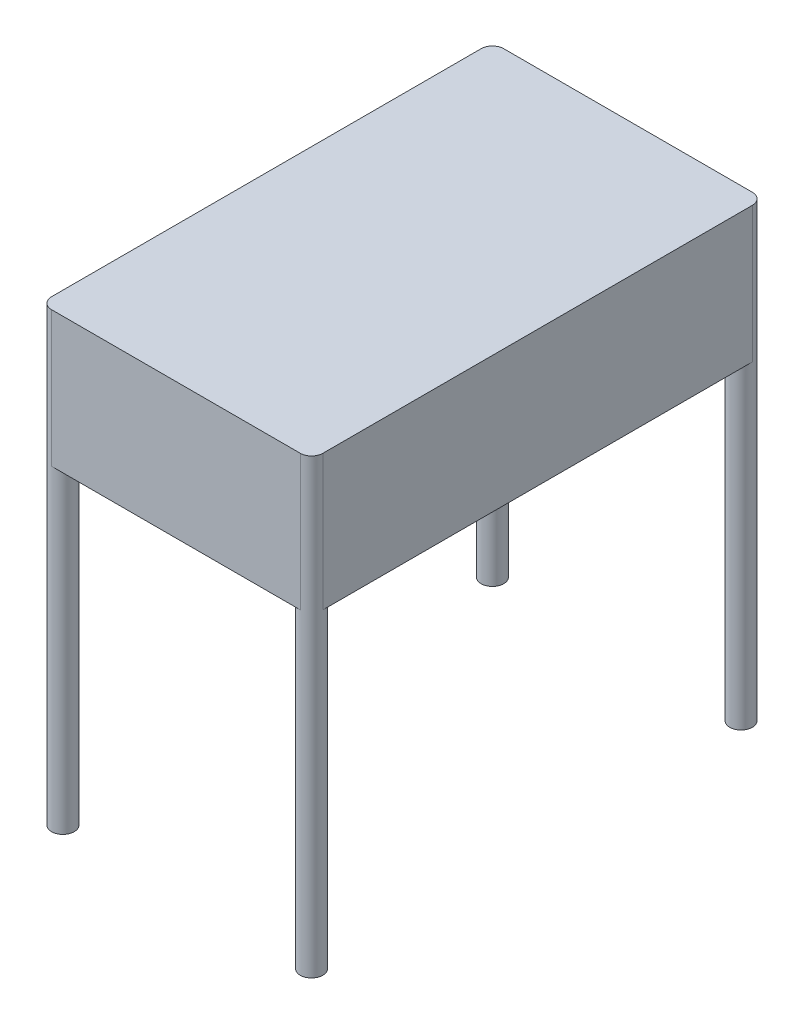
ISO-10303-21;
HEADER;
FILE_DESCRIPTION(('STEP AP214'),'2;1');
FILE_NAME('part.step','',(''),(''),'','','');
FILE_SCHEMA(('AUTOMOTIVE_DESIGN { 1 0 10303 214 1 1 1 1 }'));
ENDSEC;
DATA;
#1=APPLICATION_CONTEXT('core data for automotive mechanical design processes');
#2=APPLICATION_PROTOCOL_DEFINITION('international standard','automotive_design',2000,#1);
#3=PRODUCT_CONTEXT('',#1,'mechanical');
#4=PRODUCT('Part','Part','',(#3));
#5=PRODUCT_RELATED_PRODUCT_CATEGORY('part','',(#4));
#6=PRODUCT_DEFINITION_FORMATION('','',#4);
#7=PRODUCT_DEFINITION_CONTEXT('part definition',#1,'design');
#8=PRODUCT_DEFINITION('design','',#6,#7);
#9=PRODUCT_DEFINITION_SHAPE('','',#8);
#10=(LENGTH_UNIT() NAMED_UNIT(*) SI_UNIT(.MILLI.,.METRE.));
#11=(NAMED_UNIT(*) PLANE_ANGLE_UNIT() SI_UNIT($,.RADIAN.));
#12=(NAMED_UNIT(*) SI_UNIT($,.STERADIAN.) SOLID_ANGLE_UNIT());
#13=UNCERTAINTY_MEASURE_WITH_UNIT(LENGTH_MEASURE(1.E-05),#10,'distance_accuracy_value','');
#14=(GEOMETRIC_REPRESENTATION_CONTEXT(3) GLOBAL_UNCERTAINTY_ASSIGNED_CONTEXT((#13)) GLOBAL_UNIT_ASSIGNED_CONTEXT((#10,
#11,#12)) REPRESENTATION_CONTEXT('',''));
#15=CARTESIAN_POINT('',(0.,0.,0.));
#16=DIRECTION('',(0.,0.,1.));
#17=DIRECTION('',(1.,0.,0.));
#18=AXIS2_PLACEMENT_3D('',#15,#16,#17);
#19=CARTESIAN_POINT('',(0.,-300.,0.));
#20=DIRECTION('',(0.,-1.,0.));
#21=DIRECTION('',(0.,0.,-1.));
#22=AXIS2_PLACEMENT_3D('',#19,#20,#21);
#23=PLANE('',#22);
#24=CARTESIAN_POINT('',(-275.,-300.,-475.));
#25=DIRECTION('',(0.,-1.,0.));
#26=DIRECTION('',(0.,0.,-1.));
#27=AXIS2_PLACEMENT_3D('',#24,#25,#26);
#28=CIRCLE('',#27,25.);
#29=CARTESIAN_POINT('',(-275.,-300.,-500.));
#30=VERTEX_POINT('',#29);
#31=CARTESIAN_POINT('',(-300.,-300.,-475.));
#32=VERTEX_POINT('',#31);
#33=EDGE_CURVE('E106',#30,#32,#28,.T.);
#34=ORIENTED_EDGE('',*,*,#33,.F.);
#35=DIRECTION('',(-1.,0.,0.));
#36=VECTOR('',#35,1.);
#37=CARTESIAN_POINT('',(-300.,-300.,-500.));
#38=LINE('',#37,#36);
#39=CARTESIAN_POINT('',(275.,-300.,-500.));
#40=VERTEX_POINT('',#39);
#41=EDGE_CURVE('E115',#40,#30,#38,.T.);
#42=ORIENTED_EDGE('',*,*,#41,.F.);
#43=CARTESIAN_POINT('',(275.,-300.,-475.));
#44=DIRECTION('',(0.,-1.,0.));
#45=DIRECTION('',(0.,0.,-1.));
#46=AXIS2_PLACEMENT_3D('',#43,#44,#45);
#47=CIRCLE('',#46,25.);
#48=CARTESIAN_POINT('',(300.,-300.,-475.));
#49=VERTEX_POINT('',#48);
#50=EDGE_CURVE('E127',#40,#49,#47,.F.);
#51=ORIENTED_EDGE('',*,*,#50,.T.);
#52=DIRECTION('',(0.,0.,-1.));
#53=VECTOR('',#52,1.);
#54=CARTESIAN_POINT('',(300.,-300.,500.));
#55=LINE('',#54,#53);
#56=CARTESIAN_POINT('',(300.,-300.,475.));
#57=VERTEX_POINT('',#56);
#58=EDGE_CURVE('E121',#57,#49,#55,.T.);
#59=ORIENTED_EDGE('',*,*,#58,.F.);
#60=CARTESIAN_POINT('',(275.,-300.,475.));
#61=DIRECTION('',(0.,-1.,0.));
#62=DIRECTION('',(0.,0.,-1.));
#63=AXIS2_PLACEMENT_3D('',#60,#61,#62);
#64=CIRCLE('',#63,25.);
#65=CARTESIAN_POINT('',(275.,-300.,500.));
#66=VERTEX_POINT('',#65);
#67=EDGE_CURVE('E50',#66,#57,#64,.T.);
#68=ORIENTED_EDGE('',*,*,#67,.F.);
#69=DIRECTION('',(1.,0.,0.));
#70=VECTOR('',#69,1.);
#71=CARTESIAN_POINT('',(-300.,-300.,500.));
#72=LINE('',#71,#70);
#73=CARTESIAN_POINT('',(-275.,-300.,500.));
#74=VERTEX_POINT('',#73);
#75=EDGE_CURVE('E146',#74,#66,#72,.T.);
#76=ORIENTED_EDGE('',*,*,#75,.F.);
#77=CARTESIAN_POINT('',(-275.,-300.,475.));
#78=DIRECTION('',(0.,-1.,0.));
#79=DIRECTION('',(0.,0.,-1.));
#80=AXIS2_PLACEMENT_3D('',#77,#78,#79);
#81=CIRCLE('',#80,25.);
#82=CARTESIAN_POINT('',(-300.,-300.,475.));
#83=VERTEX_POINT('',#82);
#84=EDGE_CURVE('E56',#74,#83,#81,.F.);
#85=ORIENTED_EDGE('',*,*,#84,.T.);
#86=DIRECTION('',(0.,0.,1.));
#87=VECTOR('',#86,1.);
#88=CARTESIAN_POINT('',(-300.,-300.,500.));
#89=LINE('',#88,#87);
#90=EDGE_CURVE('E120',#32,#83,#89,.T.);
#91=ORIENTED_EDGE('',*,*,#90,.F.);
#92=EDGE_LOOP('',(#34,#42,#51,#59,#68,#76,#85,#91));
#93=FACE_BOUND('',#92,.T.);
#94=ADVANCED_FACE('F35',(#93),#23,.T.);
#95=CARTESIAN_POINT('',(300.,-300.,500.));
#96=DIRECTION('',(1.,0.,0.));
#97=DIRECTION('',(0.,0.,-1.));
#98=AXIS2_PLACEMENT_3D('',#95,#96,#97);
#99=PLANE('',#98);
#100=ORIENTED_EDGE('',*,*,#58,.T.);
#101=DIRECTION('',(0.,1.,0.));
#102=VECTOR('',#101,1.);
#103=CARTESIAN_POINT('',(300.,-300.,-475.));
#104=LINE('',#103,#102);
#105=CARTESIAN_POINT('',(300.,0.,-475.));
#106=VERTEX_POINT('',#105);
#107=EDGE_CURVE('E172',#49,#106,#104,.T.);
#108=ORIENTED_EDGE('',*,*,#107,.T.);
#109=DIRECTION('',(0.,0.,-1.));
#110=VECTOR('',#109,1.);
#111=CARTESIAN_POINT('',(300.,0.,500.));
#112=LINE('',#111,#110);
#113=CARTESIAN_POINT('',(300.,0.,475.));
#114=VERTEX_POINT('',#113);
#115=EDGE_CURVE('E141',#114,#106,#112,.T.);
#116=ORIENTED_EDGE('',*,*,#115,.F.);
#117=DIRECTION('',(0.,1.,0.));
#118=VECTOR('',#117,1.);
#119=CARTESIAN_POINT('',(300.,-300.,475.));
#120=LINE('',#119,#118);
#121=EDGE_CURVE('E169',#114,#57,#120,.F.);
#122=ORIENTED_EDGE('',*,*,#121,.T.);
#123=EDGE_LOOP('',(#100,#108,#116,#122));
#124=FACE_BOUND('',#123,.T.);
#125=ADVANCED_FACE('F198',(#124),#99,.T.);
#126=CARTESIAN_POINT('',(-300.,-300.,500.));
#127=DIRECTION('',(0.,0.,1.));
#128=DIRECTION('',(1.,0.,0.));
#129=AXIS2_PLACEMENT_3D('',#126,#127,#128);
#130=PLANE('',#129);
#131=DIRECTION('',(1.,0.,0.));
#132=VECTOR('',#131,1.);
#133=CARTESIAN_POINT('',(-300.,0.,500.));
#134=LINE('',#133,#132);
#135=CARTESIAN_POINT('',(-275.,0.,500.));
#136=VERTEX_POINT('',#135);
#137=CARTESIAN_POINT('',(275.,0.,500.));
#138=VERTEX_POINT('',#137);
#139=EDGE_CURVE('E143',#136,#138,#134,.T.);
#140=ORIENTED_EDGE('',*,*,#139,.F.);
#141=DIRECTION('',(0.,1.,0.));
#142=VECTOR('',#141,1.);
#143=CARTESIAN_POINT('',(-275.,-300.,500.));
#144=LINE('',#143,#142);
#145=EDGE_CURVE('E11',#136,#74,#144,.F.);
#146=ORIENTED_EDGE('',*,*,#145,.T.);
#147=ORIENTED_EDGE('',*,*,#75,.T.);
#148=DIRECTION('',(0.,1.,0.));
#149=VECTOR('',#148,1.);
#150=CARTESIAN_POINT('',(275.,-300.,500.));
#151=LINE('',#150,#149);
#152=EDGE_CURVE('E43',#66,#138,#151,.T.);
#153=ORIENTED_EDGE('',*,*,#152,.T.);
#154=EDGE_LOOP('',(#140,#146,#147,#153));
#155=FACE_BOUND('',#154,.T.);
#156=ADVANCED_FACE('F178',(#155),#130,.T.);
#157=CARTESIAN_POINT('',(-300.,-300.,500.));
#158=DIRECTION('',(-1.,0.,0.));
#159=DIRECTION('',(0.,0.,1.));
#160=AXIS2_PLACEMENT_3D('',#157,#158,#159);
#161=PLANE('',#160);
#162=DIRECTION('',(0.,0.,1.));
#163=VECTOR('',#162,1.);
#164=CARTESIAN_POINT('',(-300.,0.,500.));
#165=LINE('',#164,#163);
#166=CARTESIAN_POINT('',(-300.,0.,-475.));
#167=VERTEX_POINT('',#166);
#168=CARTESIAN_POINT('',(-300.,0.,475.));
#169=VERTEX_POINT('',#168);
#170=EDGE_CURVE('E152',#167,#169,#165,.T.);
#171=ORIENTED_EDGE('',*,*,#170,.F.);
#172=DIRECTION('',(0.,1.,0.));
#173=VECTOR('',#172,1.);
#174=CARTESIAN_POINT('',(-300.,-300.,-475.));
#175=LINE('',#174,#173);
#176=EDGE_CURVE('E167',#167,#32,#175,.F.);
#177=ORIENTED_EDGE('',*,*,#176,.T.);
#178=ORIENTED_EDGE('',*,*,#90,.T.);
#179=DIRECTION('',(0.,1.,0.));
#180=VECTOR('',#179,1.);
#181=CARTESIAN_POINT('',(-300.,-300.,475.));
#182=LINE('',#181,#180);
#183=EDGE_CURVE('E164',#83,#169,#182,.T.);
#184=ORIENTED_EDGE('',*,*,#183,.T.);
#185=EDGE_LOOP('',(#171,#177,#178,#184));
#186=FACE_BOUND('',#185,.T.);
#187=ADVANCED_FACE('F190',(#186),#161,.T.);
#188=CARTESIAN_POINT('',(-300.,-300.,-500.));
#189=DIRECTION('',(0.,0.,-1.));
#190=DIRECTION('',(-1.,0.,0.));
#191=AXIS2_PLACEMENT_3D('',#188,#189,#190);
#192=PLANE('',#191);
#193=ORIENTED_EDGE('',*,*,#41,.T.);
#194=DIRECTION('',(0.,1.,0.));
#195=VECTOR('',#194,1.);
#196=CARTESIAN_POINT('',(-275.,-300.,-500.));
#197=LINE('',#196,#195);
#198=CARTESIAN_POINT('',(-275.,0.,-500.));
#199=VERTEX_POINT('',#198);
#200=EDGE_CURVE('E100',#30,#199,#197,.T.);
#201=ORIENTED_EDGE('',*,*,#200,.T.);
#202=DIRECTION('',(-1.,0.,0.));
#203=VECTOR('',#202,1.);
#204=CARTESIAN_POINT('',(-300.,0.,-500.));
#205=LINE('',#204,#203);
#206=CARTESIAN_POINT('',(275.,0.,-500.));
#207=VERTEX_POINT('',#206);
#208=EDGE_CURVE('E150',#207,#199,#205,.T.);
#209=ORIENTED_EDGE('',*,*,#208,.F.);
#210=DIRECTION('',(0.,1.,0.));
#211=VECTOR('',#210,1.);
#212=CARTESIAN_POINT('',(275.,-300.,-500.));
#213=LINE('',#212,#211);
#214=EDGE_CURVE('E112',#207,#40,#213,.F.);
#215=ORIENTED_EDGE('',*,*,#214,.T.);
#216=EDGE_LOOP('',(#193,#201,#209,#215));
#217=FACE_BOUND('',#216,.T.);
#218=ADVANCED_FACE('F116',(#217),#192,.T.);
#219=CARTESIAN_POINT('',(0.,0.,0.));
#220=DIRECTION('',(0.,-1.,0.));
#221=DIRECTION('',(0.,0.,-1.));
#222=AXIS2_PLACEMENT_3D('',#219,#220,#221);
#223=PLANE('',#222);
#224=ORIENTED_EDGE('',*,*,#208,.T.);
#225=CARTESIAN_POINT('',(-275.,0.,-475.));
#226=DIRECTION('',(0.,-1.,0.));
#227=DIRECTION('',(0.,0.,-1.));
#228=AXIS2_PLACEMENT_3D('',#225,#226,#227);
#229=CIRCLE('',#228,25.);
#230=EDGE_CURVE('E107',#199,#167,#229,.F.);
#231=ORIENTED_EDGE('',*,*,#230,.T.);
#232=ORIENTED_EDGE('',*,*,#170,.T.);
#233=CARTESIAN_POINT('',(-275.,0.,475.));
#234=DIRECTION('',(0.,-1.,0.));
#235=DIRECTION('',(0.,0.,-1.));
#236=AXIS2_PLACEMENT_3D('',#233,#234,#235);
#237=CIRCLE('',#236,25.);
#238=EDGE_CURVE('E159',#169,#136,#237,.F.);
#239=ORIENTED_EDGE('',*,*,#238,.T.);
#240=ORIENTED_EDGE('',*,*,#139,.T.);
#241=CARTESIAN_POINT('',(275.,0.,475.));
#242=DIRECTION('',(0.,-1.,0.));
#243=DIRECTION('',(0.,0.,-1.));
#244=AXIS2_PLACEMENT_3D('',#241,#242,#243);
#245=CIRCLE('',#244,25.);
#246=EDGE_CURVE('E111',#138,#114,#245,.F.);
#247=ORIENTED_EDGE('',*,*,#246,.T.);
#248=ORIENTED_EDGE('',*,*,#115,.T.);
#249=CARTESIAN_POINT('',(275.,0.,-475.));
#250=DIRECTION('',(0.,-1.,0.));
#251=DIRECTION('',(0.,0.,-1.));
#252=AXIS2_PLACEMENT_3D('',#249,#250,#251);
#253=CIRCLE('',#252,25.);
#254=EDGE_CURVE('E161',#106,#207,#253,.F.);
#255=ORIENTED_EDGE('',*,*,#254,.T.);
#256=EDGE_LOOP('',(#224,#231,#232,#239,#240,#247,#248,#255));
#257=FACE_BOUND('',#256,.T.);
#258=ADVANCED_FACE('F182',(#257),#223,.F.);
#259=CARTESIAN_POINT('',(-275.,-300.,-475.));
#260=DIRECTION('',(0.,1.,0.));
#261=DIRECTION('',(0.,0.,1.));
#262=AXIS2_PLACEMENT_3D('',#259,#260,#261);
#263=CYLINDRICAL_SURFACE('',#262,25.);
#264=ORIENTED_EDGE('',*,*,#200,.F.);
#265=ORIENTED_EDGE('',*,*,#33,.T.);
#266=ORIENTED_EDGE('',*,*,#176,.F.);
#267=ORIENTED_EDGE('',*,*,#230,.F.);
#268=EDGE_LOOP('',(#264,#265,#266,#267));
#269=FACE_BOUND('',#268,.T.);
#270=CARTESIAN_POINT('',(-275.,-1000.,-475.));
#271=DIRECTION('',(0.,1.,0.));
#272=DIRECTION('',(0.,0.,-1.));
#273=AXIS2_PLACEMENT_3D('',#270,#271,#272);
#274=CIRCLE('',#273,25.);
#275=CARTESIAN_POINT('',(-275.,-1000.,-500.));
#276=VERTEX_POINT('',#275);
#277=EDGE_CURVE('E124',#276,#276,#274,.T.);
#278=ORIENTED_EDGE('',*,*,#277,.T.);
#279=EDGE_LOOP('',(#278));
#280=FACE_BOUND('',#279,.T.);
#281=ADVANCED_FACE('F102',(#269,#280),#263,.T.);
#282=CARTESIAN_POINT('',(275.,-300.,-475.));
#283=DIRECTION('',(0.,1.,0.));
#284=DIRECTION('',(0.,0.,1.));
#285=AXIS2_PLACEMENT_3D('',#282,#283,#284);
#286=CYLINDRICAL_SURFACE('',#285,25.);
#287=ORIENTED_EDGE('',*,*,#107,.F.);
#288=ORIENTED_EDGE('',*,*,#50,.F.);
#289=ORIENTED_EDGE('',*,*,#214,.F.);
#290=ORIENTED_EDGE('',*,*,#254,.F.);
#291=EDGE_LOOP('',(#287,#288,#289,#290));
#292=FACE_BOUND('',#291,.T.);
#293=CARTESIAN_POINT('',(275.,-1000.,-475.));
#294=DIRECTION('',(0.,-1.,0.));
#295=DIRECTION('',(0.,0.,-1.));
#296=AXIS2_PLACEMENT_3D('',#293,#294,#295);
#297=CIRCLE('',#296,25.);
#298=CARTESIAN_POINT('',(275.,-1000.,-500.));
#299=VERTEX_POINT('',#298);
#300=EDGE_CURVE('E123',#299,#299,#297,.T.);
#301=ORIENTED_EDGE('',*,*,#300,.F.);
#302=EDGE_LOOP('',(#301));
#303=FACE_BOUND('',#302,.T.);
#304=ADVANCED_FACE('F215',(#292,#303),#286,.T.);
#305=CARTESIAN_POINT('',(-275.,-300.,475.));
#306=DIRECTION('',(0.,1.,0.));
#307=DIRECTION('',(0.,0.,1.));
#308=AXIS2_PLACEMENT_3D('',#305,#306,#307);
#309=CYLINDRICAL_SURFACE('',#308,25.);
#310=ORIENTED_EDGE('',*,*,#183,.F.);
#311=ORIENTED_EDGE('',*,*,#84,.F.);
#312=ORIENTED_EDGE('',*,*,#145,.F.);
#313=ORIENTED_EDGE('',*,*,#238,.F.);
#314=EDGE_LOOP('',(#310,#311,#312,#313));
#315=FACE_BOUND('',#314,.T.);
#316=CARTESIAN_POINT('',(-275.,-1000.,475.));
#317=DIRECTION('',(0.,-1.,0.));
#318=DIRECTION('',(0.,0.,1.));
#319=AXIS2_PLACEMENT_3D('',#316,#317,#318);
#320=CIRCLE('',#319,25.);
#321=CARTESIAN_POINT('',(-275.,-1000.,500.));
#322=VERTEX_POINT('',#321);
#323=EDGE_CURVE('E133',#322,#322,#320,.T.);
#324=ORIENTED_EDGE('',*,*,#323,.F.);
#325=EDGE_LOOP('',(#324));
#326=FACE_BOUND('',#325,.T.);
#327=ADVANCED_FACE('F187',(#315,#326),#309,.T.);
#328=CARTESIAN_POINT('',(275.,-300.,475.));
#329=DIRECTION('',(0.,1.,0.));
#330=DIRECTION('',(0.,0.,1.));
#331=AXIS2_PLACEMENT_3D('',#328,#329,#330);
#332=CYLINDRICAL_SURFACE('',#331,25.);
#333=ORIENTED_EDGE('',*,*,#152,.F.);
#334=ORIENTED_EDGE('',*,*,#67,.T.);
#335=ORIENTED_EDGE('',*,*,#121,.F.);
#336=ORIENTED_EDGE('',*,*,#246,.F.);
#337=EDGE_LOOP('',(#333,#334,#335,#336));
#338=FACE_BOUND('',#337,.T.);
#339=CARTESIAN_POINT('',(275.,-1000.,475.));
#340=DIRECTION('',(0.,1.,0.));
#341=DIRECTION('',(0.,0.,1.));
#342=AXIS2_PLACEMENT_3D('',#339,#340,#341);
#343=CIRCLE('',#342,25.);
#344=CARTESIAN_POINT('',(275.,-1000.,500.));
#345=VERTEX_POINT('',#344);
#346=EDGE_CURVE('E137',#345,#345,#343,.T.);
#347=ORIENTED_EDGE('',*,*,#346,.T.);
#348=EDGE_LOOP('',(#347));
#349=FACE_BOUND('',#348,.T.);
#350=ADVANCED_FACE('F37',(#338,#349),#332,.T.);
#351=CARTESIAN_POINT('',(275.,-1000.,475.));
#352=DIRECTION('',(0.,1.,0.));
#353=DIRECTION('',(0.,0.,1.));
#354=AXIS2_PLACEMENT_3D('',#351,#352,#353);
#355=PLANE('',#354);
#356=ORIENTED_EDGE('',*,*,#346,.F.);
#357=EDGE_LOOP('',(#356));
#358=FACE_BOUND('',#357,.T.);
#359=ADVANCED_FACE('F209',(#358),#355,.F.);
#360=CARTESIAN_POINT('',(-275.,-1000.,475.));
#361=DIRECTION('',(0.,1.,0.));
#362=DIRECTION('',(0.,0.,1.));
#363=AXIS2_PLACEMENT_3D('',#360,#361,#362);
#364=PLANE('',#363);
#365=ORIENTED_EDGE('',*,*,#323,.T.);
#366=EDGE_LOOP('',(#365));
#367=FACE_BOUND('',#366,.T.);
#368=ADVANCED_FACE('F229',(#367),#364,.F.);
#369=CARTESIAN_POINT('',(275.,-1000.,-475.));
#370=DIRECTION('',(0.,1.,0.));
#371=DIRECTION('',(0.,0.,-1.));
#372=AXIS2_PLACEMENT_3D('',#369,#370,#371);
#373=PLANE('',#372);
#374=ORIENTED_EDGE('',*,*,#300,.T.);
#375=EDGE_LOOP('',(#374));
#376=FACE_BOUND('',#375,.T.);
#377=ADVANCED_FACE('F236',(#376),#373,.F.);
#378=CARTESIAN_POINT('',(-275.,-1000.,-475.));
#379=DIRECTION('',(0.,1.,0.));
#380=DIRECTION('',(0.,0.,-1.));
#381=AXIS2_PLACEMENT_3D('',#378,#379,#380);
#382=PLANE('',#381);
#383=ORIENTED_EDGE('',*,*,#277,.F.);
#384=EDGE_LOOP('',(#383));
#385=FACE_BOUND('',#384,.T.);
#386=ADVANCED_FACE('F241',(#385),#382,.F.);
#387=CLOSED_SHELL('',(#94,#125,#156,#187,#218,#258,#281,#304,#327,#350,#359,#368,#377,#386));
#388=MANIFOLD_SOLID_BREP('B2',#387);
#389=ADVANCED_BREP_SHAPE_REPRESENTATION('',(#18,#388),#14);
#390=SHAPE_DEFINITION_REPRESENTATION(#9,#389);
ENDSEC;
END-ISO-10303-21;
